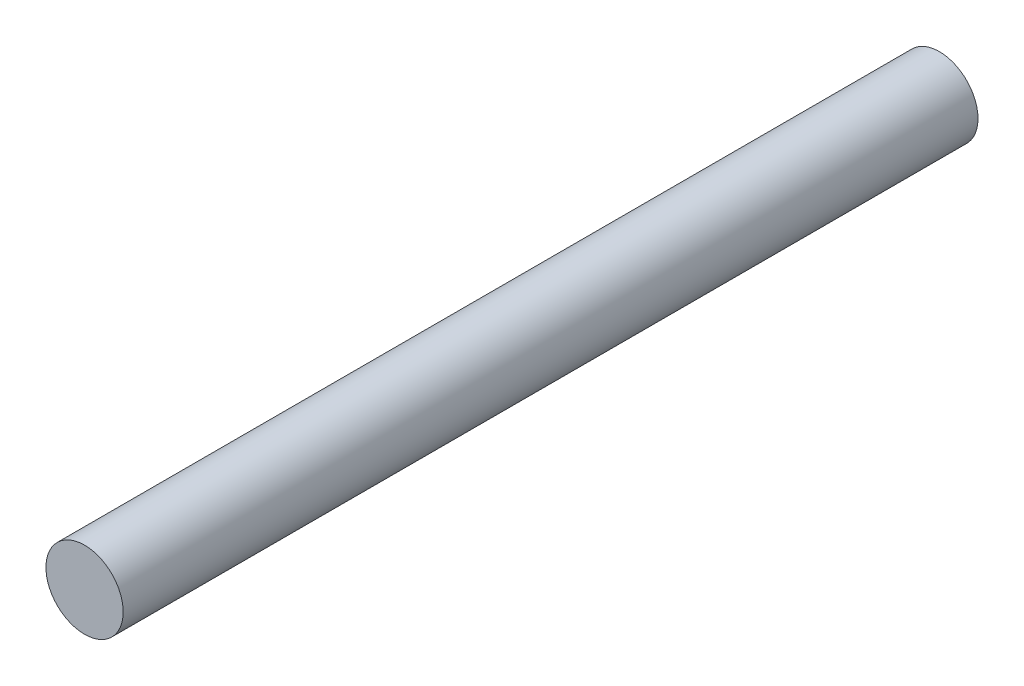
ISO-10303-21;
HEADER;
FILE_DESCRIPTION(('STEP AP214'),'2;1');
FILE_NAME('part.step','',(''),(''),'','','');
FILE_SCHEMA(('AUTOMOTIVE_DESIGN { 1 0 10303 214 1 1 1 1 }'));
ENDSEC;
DATA;
#1=APPLICATION_CONTEXT('core data for automotive mechanical design processes');
#2=APPLICATION_PROTOCOL_DEFINITION('international standard','automotive_design',2000,#1);
#3=PRODUCT_CONTEXT('',#1,'mechanical');
#4=PRODUCT('Part','Part','',(#3));
#5=PRODUCT_RELATED_PRODUCT_CATEGORY('part','',(#4));
#6=PRODUCT_DEFINITION_FORMATION('','',#4);
#7=PRODUCT_DEFINITION_CONTEXT('part definition',#1,'design');
#8=PRODUCT_DEFINITION('design','',#6,#7);
#9=PRODUCT_DEFINITION_SHAPE('','',#8);
#10=(LENGTH_UNIT() NAMED_UNIT(*) SI_UNIT(.MILLI.,.METRE.));
#11=(NAMED_UNIT(*) PLANE_ANGLE_UNIT() SI_UNIT($,.RADIAN.));
#12=(NAMED_UNIT(*) SI_UNIT($,.STERADIAN.) SOLID_ANGLE_UNIT());
#13=UNCERTAINTY_MEASURE_WITH_UNIT(LENGTH_MEASURE(1.E-05),#10,'distance_accuracy_value','');
#14=(GEOMETRIC_REPRESENTATION_CONTEXT(3) GLOBAL_UNCERTAINTY_ASSIGNED_CONTEXT((#13)) GLOBAL_UNIT_ASSIGNED_CONTEXT((#10,
#11,#12)) REPRESENTATION_CONTEXT('',''));
#15=CARTESIAN_POINT('',(0.,0.,0.));
#16=DIRECTION('',(0.,0.,1.));
#17=DIRECTION('',(1.,0.,0.));
#18=AXIS2_PLACEMENT_3D('',#15,#16,#17);
#19=CARTESIAN_POINT('',(0.,0.,26.6954));
#20=DIRECTION('',(0.,0.,-1.));
#21=DIRECTION('',(-1.,0.,0.));
#22=AXIS2_PLACEMENT_3D('',#19,#20,#21);
#23=CYLINDRICAL_SURFACE('',#22,1.2065);
#24=CARTESIAN_POINT('',(0.,0.,26.6954));
#25=DIRECTION('',(0.,0.,1.));
#26=DIRECTION('',(1.,0.,0.));
#27=AXIS2_PLACEMENT_3D('',#24,#25,#26);
#28=CIRCLE('',#27,1.2065);
#29=CARTESIAN_POINT('',(1.2065,0.,26.6954));
#30=VERTEX_POINT('',#29);
#31=EDGE_CURVE('E10',#30,#30,#28,.T.);
#32=ORIENTED_EDGE('',*,*,#31,.F.);
#33=EDGE_LOOP('',(#32));
#34=FACE_BOUND('',#33,.T.);
#35=CARTESIAN_POINT('',(0.,0.,0.));
#36=DIRECTION('',(0.,0.,1.));
#37=DIRECTION('',(1.,0.,0.));
#38=AXIS2_PLACEMENT_3D('',#35,#36,#37);
#39=CIRCLE('',#38,1.2065);
#40=CARTESIAN_POINT('',(1.2065,0.,0.));
#41=VERTEX_POINT('',#40);
#42=EDGE_CURVE('E33',#41,#41,#39,.T.);
#43=ORIENTED_EDGE('',*,*,#42,.T.);
#44=EDGE_LOOP('',(#43));
#45=FACE_BOUND('',#44,.T.);
#46=ADVANCED_FACE('F30',(#34,#45),#23,.T.);
#47=CARTESIAN_POINT('',(0.,0.,26.6954));
#48=DIRECTION('',(0.,0.,1.));
#49=DIRECTION('',(1.,0.,0.));
#50=AXIS2_PLACEMENT_3D('',#47,#48,#49);
#51=PLANE('',#50);
#52=ORIENTED_EDGE('',*,*,#31,.T.);
#53=EDGE_LOOP('',(#52));
#54=FACE_BOUND('',#53,.T.);
#55=ADVANCED_FACE('F45',(#54),#51,.T.);
#56=CARTESIAN_POINT('',(0.,0.,0.));
#57=DIRECTION('',(0.,0.,1.));
#58=DIRECTION('',(1.,0.,0.));
#59=AXIS2_PLACEMENT_3D('',#56,#57,#58);
#60=PLANE('',#59);
#61=ORIENTED_EDGE('',*,*,#42,.F.);
#62=EDGE_LOOP('',(#61));
#63=FACE_BOUND('',#62,.T.);
#64=ADVANCED_FACE('F43',(#63),#60,.F.);
#65=CLOSED_SHELL('',(#46,#55,#64));
#66=MANIFOLD_SOLID_BREP('B2',#65);
#67=ADVANCED_BREP_SHAPE_REPRESENTATION('',(#18,#66),#14);
#68=SHAPE_DEFINITION_REPRESENTATION(#9,#67);
ENDSEC;
END-ISO-10303-21;
